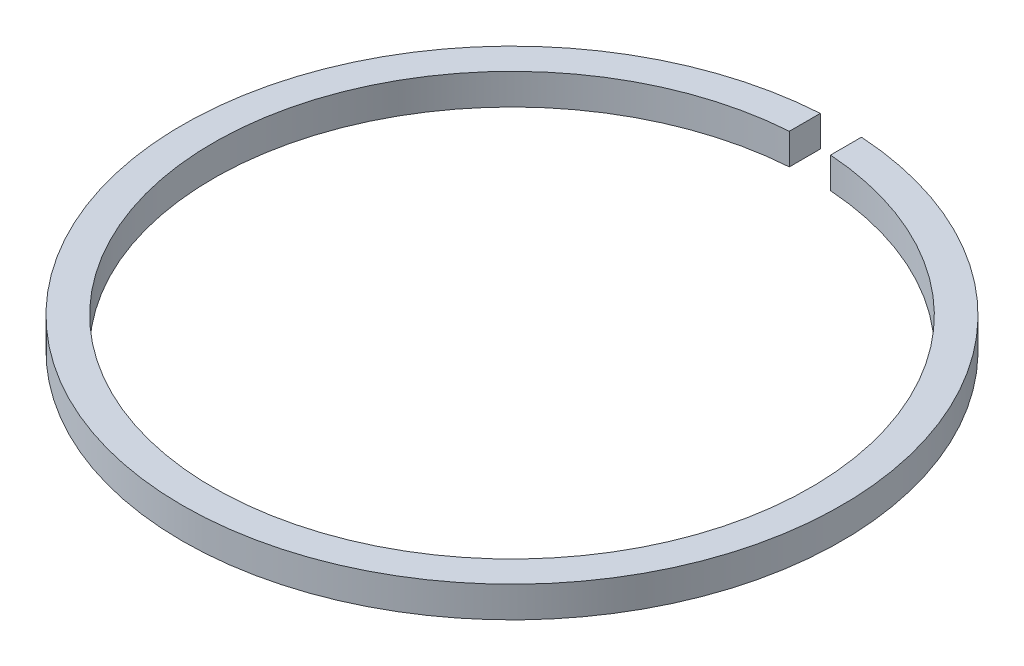
ISO-10303-21;
HEADER;
FILE_DESCRIPTION(('STEP AP214'),'2;1');
FILE_NAME('part.step','',(''),(''),'','','');
FILE_SCHEMA(('AUTOMOTIVE_DESIGN { 1 0 10303 214 1 1 1 1 }'));
ENDSEC;
DATA;
#1=APPLICATION_CONTEXT('core data for automotive mechanical design processes');
#2=APPLICATION_PROTOCOL_DEFINITION('international standard','automotive_design',2000,#1);
#3=PRODUCT_CONTEXT('',#1,'mechanical');
#4=PRODUCT('Part','Part','',(#3));
#5=PRODUCT_RELATED_PRODUCT_CATEGORY('part','',(#4));
#6=PRODUCT_DEFINITION_FORMATION('','',#4);
#7=PRODUCT_DEFINITION_CONTEXT('part definition',#1,'design');
#8=PRODUCT_DEFINITION('design','',#6,#7);
#9=PRODUCT_DEFINITION_SHAPE('','',#8);
#10=(LENGTH_UNIT() NAMED_UNIT(*) SI_UNIT(.MILLI.,.METRE.));
#11=(NAMED_UNIT(*) PLANE_ANGLE_UNIT() SI_UNIT($,.RADIAN.));
#12=(NAMED_UNIT(*) SI_UNIT($,.STERADIAN.) SOLID_ANGLE_UNIT());
#13=UNCERTAINTY_MEASURE_WITH_UNIT(LENGTH_MEASURE(1.E-05),#10,'distance_accuracy_value','');
#14=(GEOMETRIC_REPRESENTATION_CONTEXT(3) GLOBAL_UNCERTAINTY_ASSIGNED_CONTEXT((#13)) GLOBAL_UNIT_ASSIGNED_CONTEXT((#10,
#11,#12)) REPRESENTATION_CONTEXT('',''));
#15=CARTESIAN_POINT('',(0.,0.,0.));
#16=DIRECTION('',(0.,0.,1.));
#17=DIRECTION('',(1.,0.,0.));
#18=AXIS2_PLACEMENT_3D('',#15,#16,#17);
#19=CARTESIAN_POINT('',(0.,1.5,0.));
#20=DIRECTION('',(0.,-1.,0.));
#21=DIRECTION('',(0.,0.,-1.));
#22=AXIS2_PLACEMENT_3D('',#19,#20,#21);
#23=CYLINDRICAL_SURFACE('',#22,14.5);
#24=CARTESIAN_POINT('',(0.,0.,0.));
#25=DIRECTION('',(0.,-1.,0.));
#26=DIRECTION('',(0.,0.,1.));
#27=AXIS2_PLACEMENT_3D('',#24,#25,#26);
#28=CIRCLE('',#27,14.5);
#29=CARTESIAN_POINT('',(1.,0.,-14.4654761414894));
#30=VERTEX_POINT('',#29);
#31=CARTESIAN_POINT('',(-1.,0.,-14.4654761414894));
#32=VERTEX_POINT('',#31);
#33=EDGE_CURVE('E107',#30,#32,#28,.T.);
#34=ORIENTED_EDGE('',*,*,#33,.T.);
#35=DIRECTION('',(0.,-1.,0.));
#36=VECTOR('',#35,1.);
#37=CARTESIAN_POINT('',(-1.,1.5,-14.4654761414894));
#38=LINE('',#37,#36);
#39=CARTESIAN_POINT('',(-1.,1.5,-14.4654761414894));
#40=VERTEX_POINT('',#39);
#41=EDGE_CURVE('E11',#40,#32,#38,.T.);
#42=ORIENTED_EDGE('',*,*,#41,.F.);
#43=CARTESIAN_POINT('',(0.,1.5,0.));
#44=DIRECTION('',(0.,-1.,0.));
#45=DIRECTION('',(0.,0.,1.));
#46=AXIS2_PLACEMENT_3D('',#43,#44,#45);
#47=CIRCLE('',#46,14.5);
#48=CARTESIAN_POINT('',(1.,1.5,-14.4654761414894));
#49=VERTEX_POINT('',#48);
#50=EDGE_CURVE('E91',#49,#40,#47,.T.);
#51=ORIENTED_EDGE('',*,*,#50,.F.);
#52=DIRECTION('',(0.,-1.,0.));
#53=VECTOR('',#52,1.);
#54=CARTESIAN_POINT('',(1.,1.5,-14.4654761414894));
#55=LINE('',#54,#53);
#56=EDGE_CURVE('E103',#49,#30,#55,.T.);
#57=ORIENTED_EDGE('',*,*,#56,.T.);
#58=EDGE_LOOP('',(#34,#42,#51,#57));
#59=FACE_BOUND('',#58,.T.);
#60=ADVANCED_FACE('F39',(#59),#23,.F.);
#61=CARTESIAN_POINT('',(-1.,1.5,-14.4654761414894));
#62=DIRECTION('',(-1.,0.,0.));
#63=DIRECTION('',(0.,0.,1.));
#64=AXIS2_PLACEMENT_3D('',#61,#62,#63);
#65=PLANE('',#64);
#66=DIRECTION('',(0.,0.,-1.));
#67=VECTOR('',#66,1.);
#68=CARTESIAN_POINT('',(-1.,0.,-14.4654761414894));
#69=LINE('',#68,#67);
#70=CARTESIAN_POINT('',(-1.,0.,-15.9687194226713));
#71=VERTEX_POINT('',#70);
#72=EDGE_CURVE('E96',#32,#71,#69,.T.);
#73=ORIENTED_EDGE('',*,*,#72,.T.);
#74=DIRECTION('',(0.,-1.,0.));
#75=VECTOR('',#74,1.);
#76=CARTESIAN_POINT('',(-1.,1.5,-15.9687194226713));
#77=LINE('',#76,#75);
#78=CARTESIAN_POINT('',(-1.,1.5,-15.9687194226713));
#79=VERTEX_POINT('',#78);
#80=EDGE_CURVE('E48',#79,#71,#77,.T.);
#81=ORIENTED_EDGE('',*,*,#80,.F.);
#82=DIRECTION('',(0.,0.,-1.));
#83=VECTOR('',#82,1.);
#84=CARTESIAN_POINT('',(-1.,1.5,-14.4654761414894));
#85=LINE('',#84,#83);
#86=EDGE_CURVE('E86',#40,#79,#85,.T.);
#87=ORIENTED_EDGE('',*,*,#86,.F.);
#88=ORIENTED_EDGE('',*,*,#41,.T.);
#89=EDGE_LOOP('',(#73,#81,#87,#88));
#90=FACE_BOUND('',#89,.T.);
#91=ADVANCED_FACE('F95',(#90),#65,.F.);
#92=CARTESIAN_POINT('',(0.,1.5,0.));
#93=DIRECTION('',(0.,-1.,0.));
#94=DIRECTION('',(0.,0.,-1.));
#95=AXIS2_PLACEMENT_3D('',#92,#93,#94);
#96=CYLINDRICAL_SURFACE('',#95,16.);
#97=CARTESIAN_POINT('',(0.,0.,0.));
#98=DIRECTION('',(0.,1.,0.));
#99=DIRECTION('',(0.,0.,1.));
#100=AXIS2_PLACEMENT_3D('',#97,#98,#99);
#101=CIRCLE('',#100,16.);
#102=CARTESIAN_POINT('',(1.,0.,-15.9687194226713));
#103=VERTEX_POINT('',#102);
#104=EDGE_CURVE('E73',#71,#103,#101,.T.);
#105=ORIENTED_EDGE('',*,*,#104,.T.);
#106=DIRECTION('',(0.,-1.,0.));
#107=VECTOR('',#106,1.);
#108=CARTESIAN_POINT('',(1.,1.5,-15.9687194226713));
#109=LINE('',#108,#107);
#110=CARTESIAN_POINT('',(1.,1.5,-15.9687194226713));
#111=VERTEX_POINT('',#110);
#112=EDGE_CURVE('E98',#111,#103,#109,.T.);
#113=ORIENTED_EDGE('',*,*,#112,.F.);
#114=CARTESIAN_POINT('',(0.,1.5,0.));
#115=DIRECTION('',(0.,1.,0.));
#116=DIRECTION('',(0.,0.,1.));
#117=AXIS2_PLACEMENT_3D('',#114,#115,#116);
#118=CIRCLE('',#117,16.);
#119=EDGE_CURVE('E89',#79,#111,#118,.T.);
#120=ORIENTED_EDGE('',*,*,#119,.F.);
#121=ORIENTED_EDGE('',*,*,#80,.T.);
#122=EDGE_LOOP('',(#105,#113,#120,#121));
#123=FACE_BOUND('',#122,.T.);
#124=ADVANCED_FACE('F99',(#123),#96,.T.);
#125=CARTESIAN_POINT('',(1.,1.5,-14.4654761414894));
#126=DIRECTION('',(1.,0.,0.));
#127=DIRECTION('',(0.,0.,-1.));
#128=AXIS2_PLACEMENT_3D('',#125,#126,#127);
#129=PLANE('',#128);
#130=DIRECTION('',(0.,0.,1.));
#131=VECTOR('',#130,1.);
#132=CARTESIAN_POINT('',(1.,0.,-14.4654761414894));
#133=LINE('',#132,#131);
#134=EDGE_CURVE('E79',#103,#30,#133,.T.);
#135=ORIENTED_EDGE('',*,*,#134,.T.);
#136=ORIENTED_EDGE('',*,*,#56,.F.);
#137=DIRECTION('',(0.,0.,1.));
#138=VECTOR('',#137,1.);
#139=CARTESIAN_POINT('',(1.,1.5,-14.4654761414894));
#140=LINE('',#139,#138);
#141=EDGE_CURVE('E56',#111,#49,#140,.T.);
#142=ORIENTED_EDGE('',*,*,#141,.F.);
#143=ORIENTED_EDGE('',*,*,#112,.T.);
#144=EDGE_LOOP('',(#135,#136,#142,#143));
#145=FACE_BOUND('',#144,.T.);
#146=ADVANCED_FACE('F120',(#145),#129,.F.);
#147=CARTESIAN_POINT('',(0.,1.5,0.));
#148=DIRECTION('',(0.,1.,0.));
#149=DIRECTION('',(0.,0.,1.));
#150=AXIS2_PLACEMENT_3D('',#147,#148,#149);
#151=PLANE('',#150);
#152=ORIENTED_EDGE('',*,*,#50,.T.);
#153=ORIENTED_EDGE('',*,*,#86,.T.);
#154=ORIENTED_EDGE('',*,*,#119,.T.);
#155=ORIENTED_EDGE('',*,*,#141,.T.);
#156=EDGE_LOOP('',(#152,#153,#154,#155));
#157=FACE_BOUND('',#156,.T.);
#158=ADVANCED_FACE('F87',(#157),#151,.T.);
#159=CARTESIAN_POINT('',(0.,0.,0.));
#160=DIRECTION('',(0.,1.,0.));
#161=DIRECTION('',(0.,0.,1.));
#162=AXIS2_PLACEMENT_3D('',#159,#160,#161);
#163=PLANE('',#162);
#164=ORIENTED_EDGE('',*,*,#33,.F.);
#165=ORIENTED_EDGE('',*,*,#134,.F.);
#166=ORIENTED_EDGE('',*,*,#104,.F.);
#167=ORIENTED_EDGE('',*,*,#72,.F.);
#168=EDGE_LOOP('',(#164,#165,#166,#167));
#169=FACE_BOUND('',#168,.T.);
#170=ADVANCED_FACE('F123',(#169),#163,.F.);
#171=CLOSED_SHELL('',(#60,#91,#124,#146,#158,#170));
#172=MANIFOLD_SOLID_BREP('B2',#171);
#173=ADVANCED_BREP_SHAPE_REPRESENTATION('',(#18,#172),#14);
#174=SHAPE_DEFINITION_REPRESENTATION(#9,#173);
ENDSEC;
END-ISO-10303-21;
